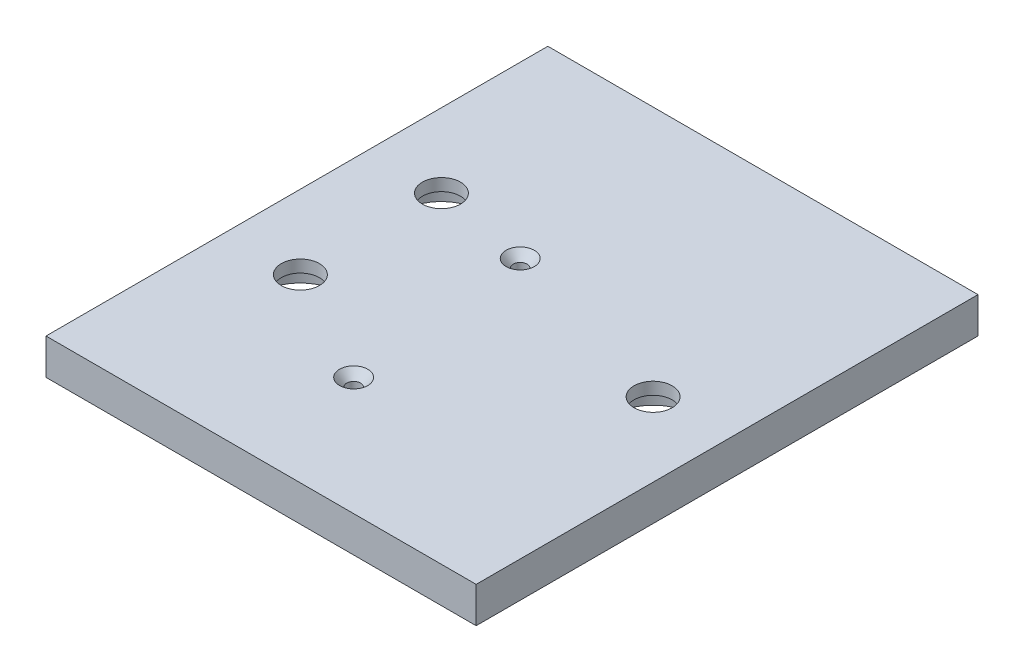
ISO-10303-21;
HEADER;
FILE_DESCRIPTION(('STEP AP214'),'2;1');
FILE_NAME('part.step','',(''),(''),'','','');
FILE_SCHEMA(('AUTOMOTIVE_DESIGN { 1 0 10303 214 1 1 1 1 }'));
ENDSEC;
DATA;
#1=APPLICATION_CONTEXT('core data for automotive mechanical design processes');
#2=APPLICATION_PROTOCOL_DEFINITION('international standard','automotive_design',2000,#1);
#3=PRODUCT_CONTEXT('',#1,'mechanical');
#4=PRODUCT('Part','Part','',(#3));
#5=PRODUCT_RELATED_PRODUCT_CATEGORY('part','',(#4));
#6=PRODUCT_DEFINITION_FORMATION('','',#4);
#7=PRODUCT_DEFINITION_CONTEXT('part definition',#1,'design');
#8=PRODUCT_DEFINITION('design','',#6,#7);
#9=PRODUCT_DEFINITION_SHAPE('','',#8);
#10=(LENGTH_UNIT() NAMED_UNIT(*) SI_UNIT(.MILLI.,.METRE.));
#11=(NAMED_UNIT(*) PLANE_ANGLE_UNIT() SI_UNIT($,.RADIAN.));
#12=(NAMED_UNIT(*) SI_UNIT($,.STERADIAN.) SOLID_ANGLE_UNIT());
#13=UNCERTAINTY_MEASURE_WITH_UNIT(LENGTH_MEASURE(1.E-05),#10,'distance_accuracy_value','');
#14=(GEOMETRIC_REPRESENTATION_CONTEXT(3) GLOBAL_UNCERTAINTY_ASSIGNED_CONTEXT((#13)) GLOBAL_UNIT_ASSIGNED_CONTEXT((#10,
#11,#12)) REPRESENTATION_CONTEXT('',''));
#15=CARTESIAN_POINT('',(0.,0.,0.));
#16=DIRECTION('',(0.,0.,1.));
#17=DIRECTION('',(1.,0.,0.));
#18=AXIS2_PLACEMENT_3D('',#15,#16,#17);
#19=CARTESIAN_POINT('',(0.,6.35,0.));
#20=DIRECTION('',(1.,0.,0.));
#21=DIRECTION('',(0.,0.,-1.));
#22=AXIS2_PLACEMENT_3D('',#19,#20,#21);
#23=PLANE('',#22);
#24=DIRECTION('',(0.,0.,1.));
#25=VECTOR('',#24,1.);
#26=CARTESIAN_POINT('',(0.,0.,0.));
#27=LINE('',#26,#25);
#28=CARTESIAN_POINT('',(0.,0.,-88.9));
#29=VERTEX_POINT('',#28);
#30=CARTESIAN_POINT('',(0.,0.,0.));
#31=VERTEX_POINT('',#30);
#32=EDGE_CURVE('E102',#29,#31,#27,.T.);
#33=ORIENTED_EDGE('',*,*,#32,.T.);
#34=DIRECTION('',(0.,-1.,0.));
#35=VECTOR('',#34,1.);
#36=CARTESIAN_POINT('',(0.,6.35,0.));
#37=LINE('',#36,#35);
#38=CARTESIAN_POINT('',(0.,6.35,0.));
#39=VERTEX_POINT('',#38);
#40=EDGE_CURVE('E11',#39,#31,#37,.T.);
#41=ORIENTED_EDGE('',*,*,#40,.F.);
#42=DIRECTION('',(0.,0.,1.));
#43=VECTOR('',#42,1.);
#44=CARTESIAN_POINT('',(0.,6.35,0.));
#45=LINE('',#44,#43);
#46=CARTESIAN_POINT('',(0.,6.35,-88.9));
#47=VERTEX_POINT('',#46);
#48=EDGE_CURVE('E89',#47,#39,#45,.T.);
#49=ORIENTED_EDGE('',*,*,#48,.F.);
#50=DIRECTION('',(0.,-1.,0.));
#51=VECTOR('',#50,1.);
#52=CARTESIAN_POINT('',(0.,6.35,-88.9));
#53=LINE('',#52,#51);
#54=EDGE_CURVE('E98',#47,#29,#53,.T.);
#55=ORIENTED_EDGE('',*,*,#54,.T.);
#56=EDGE_LOOP('',(#33,#41,#49,#55));
#57=FACE_BOUND('',#56,.T.);
#58=ADVANCED_FACE('F36',(#57),#23,.F.);
#59=CARTESIAN_POINT('',(0.,6.35,0.));
#60=DIRECTION('',(0.,0.,-1.));
#61=DIRECTION('',(-1.,0.,0.));
#62=AXIS2_PLACEMENT_3D('',#59,#60,#61);
#63=PLANE('',#62);
#64=DIRECTION('',(1.,0.,0.));
#65=VECTOR('',#64,1.);
#66=CARTESIAN_POINT('',(0.,0.,0.));
#67=LINE('',#66,#65);
#68=CARTESIAN_POINT('',(76.2,0.,0.));
#69=VERTEX_POINT('',#68);
#70=EDGE_CURVE('E93',#31,#69,#67,.T.);
#71=ORIENTED_EDGE('',*,*,#70,.T.);
#72=DIRECTION('',(0.,-1.,0.));
#73=VECTOR('',#72,1.);
#74=CARTESIAN_POINT('',(76.2,6.35,0.));
#75=LINE('',#74,#73);
#76=CARTESIAN_POINT('',(76.2,6.35,0.));
#77=VERTEX_POINT('',#76);
#78=EDGE_CURVE('E45',#77,#69,#75,.T.);
#79=ORIENTED_EDGE('',*,*,#78,.F.);
#80=DIRECTION('',(1.,0.,0.));
#81=VECTOR('',#80,1.);
#82=CARTESIAN_POINT('',(0.,6.35,0.));
#83=LINE('',#82,#81);
#84=EDGE_CURVE('E84',#39,#77,#83,.T.);
#85=ORIENTED_EDGE('',*,*,#84,.F.);
#86=ORIENTED_EDGE('',*,*,#40,.T.);
#87=EDGE_LOOP('',(#71,#79,#85,#86));
#88=FACE_BOUND('',#87,.T.);
#89=ADVANCED_FACE('F92',(#88),#63,.F.);
#90=CARTESIAN_POINT('',(76.2,6.35,0.));
#91=DIRECTION('',(-1.,0.,0.));
#92=DIRECTION('',(0.,0.,1.));
#93=AXIS2_PLACEMENT_3D('',#90,#91,#92);
#94=PLANE('',#93);
#95=DIRECTION('',(0.,0.,-1.));
#96=VECTOR('',#95,1.);
#97=CARTESIAN_POINT('',(76.2,0.,0.));
#98=LINE('',#97,#96);
#99=CARTESIAN_POINT('',(76.2,0.,-88.9));
#100=VERTEX_POINT('',#99);
#101=EDGE_CURVE('E71',#69,#100,#98,.T.);
#102=ORIENTED_EDGE('',*,*,#101,.T.);
#103=DIRECTION('',(0.,-1.,0.));
#104=VECTOR('',#103,1.);
#105=CARTESIAN_POINT('',(76.2,6.35,-88.9));
#106=LINE('',#105,#104);
#107=CARTESIAN_POINT('',(76.2,6.35,-88.9));
#108=VERTEX_POINT('',#107);
#109=EDGE_CURVE('E94',#108,#100,#106,.T.);
#110=ORIENTED_EDGE('',*,*,#109,.F.);
#111=DIRECTION('',(0.,0.,-1.));
#112=VECTOR('',#111,1.);
#113=CARTESIAN_POINT('',(76.2,6.35,0.));
#114=LINE('',#113,#112);
#115=EDGE_CURVE('E87',#77,#108,#114,.T.);
#116=ORIENTED_EDGE('',*,*,#115,.F.);
#117=ORIENTED_EDGE('',*,*,#78,.T.);
#118=EDGE_LOOP('',(#102,#110,#116,#117));
#119=FACE_BOUND('',#118,.T.);
#120=ADVANCED_FACE('F96',(#119),#94,.F.);
#121=CARTESIAN_POINT('',(0.,6.35,-88.9));
#122=DIRECTION('',(0.,0.,1.));
#123=DIRECTION('',(1.,0.,0.));
#124=AXIS2_PLACEMENT_3D('',#121,#122,#123);
#125=PLANE('',#124);
#126=DIRECTION('',(-1.,0.,0.));
#127=VECTOR('',#126,1.);
#128=CARTESIAN_POINT('',(0.,0.,-88.9));
#129=LINE('',#128,#127);
#130=EDGE_CURVE('E77',#100,#29,#129,.T.);
#131=ORIENTED_EDGE('',*,*,#130,.T.);
#132=ORIENTED_EDGE('',*,*,#54,.F.);
#133=DIRECTION('',(-1.,0.,0.));
#134=VECTOR('',#133,1.);
#135=CARTESIAN_POINT('',(0.,6.35,-88.9));
#136=LINE('',#135,#134);
#137=EDGE_CURVE('E54',#108,#47,#136,.T.);
#138=ORIENTED_EDGE('',*,*,#137,.F.);
#139=ORIENTED_EDGE('',*,*,#109,.T.);
#140=EDGE_LOOP('',(#131,#132,#138,#139));
#141=FACE_BOUND('',#140,.T.);
#142=ADVANCED_FACE('F166',(#141),#125,.F.);
#143=CARTESIAN_POINT('',(0.,6.35,0.));
#144=DIRECTION('',(0.,-1.,0.));
#145=DIRECTION('',(0.,0.,-1.));
#146=AXIS2_PLACEMENT_3D('',#143,#144,#145);
#147=PLANE('',#146);
#148=CARTESIAN_POINT('',(63.0936000000004,6.35,-44.4500000000003));
#149=DIRECTION('',(0.,-1.,0.));
#150=DIRECTION('',(0.,0.,-1.));
#151=AXIS2_PLACEMENT_3D('',#148,#149,#150);
#152=CIRCLE('',#151,3.3782);
#153=CARTESIAN_POINT('',(63.0936000000004,6.35,-47.8282000000003));
#154=VERTEX_POINT('',#153);
#155=EDGE_CURVE('E39',#154,#154,#152,.T.);
#156=ORIENTED_EDGE('',*,*,#155,.T.);
#157=EDGE_LOOP('',(#156));
#158=FACE_BOUND('',#157,.T.);
#159=CARTESIAN_POINT('',(13.1064000000005,6.35,-31.9532000000001));
#160=DIRECTION('',(0.,-1.,0.));
#161=DIRECTION('',(0.,0.,-1.));
#162=AXIS2_PLACEMENT_3D('',#159,#160,#161);
#163=CIRCLE('',#162,3.3782);
#164=CARTESIAN_POINT('',(13.1064000000005,6.35,-35.3314000000001));
#165=VERTEX_POINT('',#164);
#166=EDGE_CURVE('E123',#165,#165,#163,.T.);
#167=ORIENTED_EDGE('',*,*,#166,.T.);
#168=EDGE_LOOP('',(#167));
#169=FACE_BOUND('',#168,.T.);
#170=CARTESIAN_POINT('',(13.1064000000004,6.35,-56.9468000000001));
#171=DIRECTION('',(0.,-1.,0.));
#172=DIRECTION('',(0.,0.,-1.));
#173=AXIS2_PLACEMENT_3D('',#170,#171,#172);
#174=CIRCLE('',#173,3.3782);
#175=CARTESIAN_POINT('',(13.1064000000004,6.35,-60.3250000000001));
#176=VERTEX_POINT('',#175);
#177=EDGE_CURVE('E119',#176,#176,#174,.T.);
#178=ORIENTED_EDGE('',*,*,#177,.T.);
#179=EDGE_LOOP('',(#178));
#180=FACE_BOUND('',#179,.T.);
#181=CARTESIAN_POINT('',(33.6000000000002,6.35,-20.9000000000002));
#182=DIRECTION('',(0.,1.,0.));
#183=DIRECTION('',(0.,0.,1.));
#184=AXIS2_PLACEMENT_3D('',#181,#182,#183);
#185=CIRCLE('',#184,2.5019);
#186=CARTESIAN_POINT('',(33.6000000000002,6.35,-18.3981000000002));
#187=VERTEX_POINT('',#186);
#188=EDGE_CURVE('E121',#187,#187,#185,.T.);
#189=ORIENTED_EDGE('',*,*,#188,.F.);
#190=EDGE_LOOP('',(#189));
#191=FACE_BOUND('',#190,.T.);
#192=CARTESIAN_POINT('',(30.1000000000003,6.35,-53.9000000000001));
#193=DIRECTION('',(0.,1.,0.));
#194=DIRECTION('',(0.,0.,1.));
#195=AXIS2_PLACEMENT_3D('',#192,#193,#194);
#196=CIRCLE('',#195,2.5019);
#197=CARTESIAN_POINT('',(30.1000000000003,6.35,-51.3981000000001));
#198=VERTEX_POINT('',#197);
#199=EDGE_CURVE('E117',#198,#198,#196,.T.);
#200=ORIENTED_EDGE('',*,*,#199,.F.);
#201=EDGE_LOOP('',(#200));
#202=FACE_BOUND('',#201,.T.);
#203=ORIENTED_EDGE('',*,*,#48,.T.);
#204=ORIENTED_EDGE('',*,*,#84,.T.);
#205=ORIENTED_EDGE('',*,*,#115,.T.);
#206=ORIENTED_EDGE('',*,*,#137,.T.);
#207=EDGE_LOOP('',(#203,#204,#205,#206));
#208=FACE_BOUND('',#207,.T.);
#209=ADVANCED_FACE('F85',(#158,#169,#180,#191,#202,#208),#147,.F.);
#210=CARTESIAN_POINT('',(0.,0.,0.));
#211=DIRECTION('',(0.,-1.,0.));
#212=DIRECTION('',(0.,0.,-1.));
#213=AXIS2_PLACEMENT_3D('',#210,#211,#212);
#214=PLANE('',#213);
#215=CARTESIAN_POINT('',(63.0936000000004,0.,-44.4500000000003));
#216=DIRECTION('',(0.,-1.,0.));
#217=DIRECTION('',(0.,0.,-1.));
#218=AXIS2_PLACEMENT_3D('',#215,#216,#217);
#219=CIRCLE('',#218,7.14375);
#220=CARTESIAN_POINT('',(63.0936000000004,0.,-51.5937500000003));
#221=VERTEX_POINT('',#220);
#222=EDGE_CURVE('E337',#221,#221,#219,.T.);
#223=ORIENTED_EDGE('',*,*,#222,.F.);
#224=EDGE_LOOP('',(#223));
#225=FACE_BOUND('',#224,.T.);
#226=CARTESIAN_POINT('',(13.1064000000005,0.,-31.9532000000001));
#227=DIRECTION('',(0.,-1.,0.));
#228=DIRECTION('',(0.,0.,-1.));
#229=AXIS2_PLACEMENT_3D('',#226,#227,#228);
#230=CIRCLE('',#229,7.14375);
#231=CARTESIAN_POINT('',(13.1064000000005,0.,-39.0969500000001));
#232=VERTEX_POINT('',#231);
#233=EDGE_CURVE('E138',#232,#232,#230,.T.);
#234=ORIENTED_EDGE('',*,*,#233,.F.);
#235=EDGE_LOOP('',(#234));
#236=FACE_BOUND('',#235,.T.);
#237=CARTESIAN_POINT('',(13.1064000000004,0.,-56.9468000000001));
#238=DIRECTION('',(0.,-1.,0.));
#239=DIRECTION('',(0.,0.,-1.));
#240=AXIS2_PLACEMENT_3D('',#237,#238,#239);
#241=CIRCLE('',#240,7.14375);
#242=CARTESIAN_POINT('',(13.1064000000004,0.,-64.0905500000001));
#243=VERTEX_POINT('',#242);
#244=EDGE_CURVE('E125',#243,#243,#241,.T.);
#245=ORIENTED_EDGE('',*,*,#244,.F.);
#246=EDGE_LOOP('',(#245));
#247=FACE_BOUND('',#246,.T.);
#248=CARTESIAN_POINT('',(33.6000000000002,0.,-20.9000000000002));
#249=DIRECTION('',(0.,-1.,0.));
#250=DIRECTION('',(0.,0.,-1.));
#251=AXIS2_PLACEMENT_3D('',#248,#249,#250);
#252=CIRCLE('',#251,1.21919999999999);
#253=CARTESIAN_POINT('',(33.6000000000002,0.,-22.1192000000001));
#254=VERTEX_POINT('',#253);
#255=EDGE_CURVE('E114',#254,#254,#252,.T.);
#256=ORIENTED_EDGE('',*,*,#255,.F.);
#257=EDGE_LOOP('',(#256));
#258=FACE_BOUND('',#257,.T.);
#259=CARTESIAN_POINT('',(30.1000000000003,0.,-53.9000000000001));
#260=DIRECTION('',(0.,-1.,0.));
#261=DIRECTION('',(0.,0.,-1.));
#262=AXIS2_PLACEMENT_3D('',#259,#260,#261);
#263=CIRCLE('',#262,1.21919999999999);
#264=CARTESIAN_POINT('',(30.1000000000003,0.,-55.1192000000001));
#265=VERTEX_POINT('',#264);
#266=EDGE_CURVE('E105',#265,#265,#263,.T.);
#267=ORIENTED_EDGE('',*,*,#266,.F.);
#268=EDGE_LOOP('',(#267));
#269=FACE_BOUND('',#268,.T.);
#270=ORIENTED_EDGE('',*,*,#32,.F.);
#271=ORIENTED_EDGE('',*,*,#130,.F.);
#272=ORIENTED_EDGE('',*,*,#101,.F.);
#273=ORIENTED_EDGE('',*,*,#70,.F.);
#274=EDGE_LOOP('',(#270,#271,#272,#273));
#275=FACE_BOUND('',#274,.T.);
#276=ADVANCED_FACE('F165',(#225,#236,#247,#258,#269,#275),#214,.T.);
#277=CARTESIAN_POINT('',(30.1000000000003,6.35,-53.9000000000001));
#278=DIRECTION('',(0.,1.,0.));
#279=DIRECTION('',(0.,0.,1.));
#280=AXIS2_PLACEMENT_3D('',#277,#278,#279);
#281=CYLINDRICAL_SURFACE('',#280,1.21919999999999);
#282=ORIENTED_EDGE('',*,*,#266,.T.);
#283=EDGE_LOOP('',(#282));
#284=FACE_BOUND('',#283,.T.);
#285=CARTESIAN_POINT('',(30.1000000000003,4.87442244405761,-53.9000000000001));
#286=DIRECTION('',(0.,1.,0.));
#287=DIRECTION('',(0.,0.,1.));
#288=AXIS2_PLACEMENT_3D('',#285,#286,#287);
#289=CIRCLE('',#288,1.2192);
#290=CARTESIAN_POINT('',(30.1000000000003,4.87442244405761,-52.6808000000001));
#291=VERTEX_POINT('',#290);
#292=EDGE_CURVE('E113',#291,#291,#289,.T.);
#293=ORIENTED_EDGE('',*,*,#292,.T.);
#294=EDGE_LOOP('',(#293));
#295=FACE_BOUND('',#294,.T.);
#296=ADVANCED_FACE('F155',(#284,#295),#281,.F.);
#297=CARTESIAN_POINT('',(30.1000000000003,6.35,-53.9000000000001));
#298=DIRECTION('',(0.,1.,0.));
#299=DIRECTION('',(0.,0.,1.));
#300=AXIS2_PLACEMENT_3D('',#297,#298,#299);
#301=CONICAL_SURFACE('',#300,2.5019,0.715584993317674);
#302=ORIENTED_EDGE('',*,*,#292,.F.);
#303=EDGE_LOOP('',(#302));
#304=FACE_BOUND('',#303,.T.);
#305=ORIENTED_EDGE('',*,*,#199,.T.);
#306=EDGE_LOOP('',(#305));
#307=FACE_BOUND('',#306,.T.);
#308=ADVANCED_FACE('F157',(#304,#307),#301,.F.);
#309=CARTESIAN_POINT('',(33.6000000000002,6.35,-20.9000000000002));
#310=DIRECTION('',(0.,1.,0.));
#311=DIRECTION('',(0.,0.,1.));
#312=AXIS2_PLACEMENT_3D('',#309,#310,#311);
#313=CYLINDRICAL_SURFACE('',#312,1.21919999999999);
#314=ORIENTED_EDGE('',*,*,#255,.T.);
#315=EDGE_LOOP('',(#314));
#316=FACE_BOUND('',#315,.T.);
#317=CARTESIAN_POINT('',(33.6000000000002,4.87442244405761,-20.9000000000002));
#318=DIRECTION('',(0.,1.,0.));
#319=DIRECTION('',(0.,0.,1.));
#320=AXIS2_PLACEMENT_3D('',#317,#318,#319);
#321=CIRCLE('',#320,1.2192);
#322=CARTESIAN_POINT('',(33.6000000000002,4.87442244405761,-19.6808000000002));
#323=VERTEX_POINT('',#322);
#324=EDGE_CURVE('E118',#323,#323,#321,.T.);
#325=ORIENTED_EDGE('',*,*,#324,.T.);
#326=EDGE_LOOP('',(#325));
#327=FACE_BOUND('',#326,.T.);
#328=ADVANCED_FACE('F160',(#316,#327),#313,.F.);
#329=CARTESIAN_POINT('',(33.6000000000002,6.35,-20.9000000000002));
#330=DIRECTION('',(0.,1.,0.));
#331=DIRECTION('',(0.,0.,1.));
#332=AXIS2_PLACEMENT_3D('',#329,#330,#331);
#333=CONICAL_SURFACE('',#332,2.5019,0.715584993317676);
#334=ORIENTED_EDGE('',*,*,#324,.F.);
#335=EDGE_LOOP('',(#334));
#336=FACE_BOUND('',#335,.T.);
#337=ORIENTED_EDGE('',*,*,#188,.T.);
#338=EDGE_LOOP('',(#337));
#339=FACE_BOUND('',#338,.T.);
#340=ADVANCED_FACE('F220',(#336,#339),#333,.F.);
#341=CARTESIAN_POINT('',(13.1064000000004,0.,-56.9468000000001));
#342=DIRECTION('',(0.,-1.,0.));
#343=DIRECTION('',(0.,0.,-1.));
#344=AXIS2_PLACEMENT_3D('',#341,#342,#343);
#345=CYLINDRICAL_SURFACE('',#344,3.3782);
#346=CARTESIAN_POINT('',(13.1064000000004,4.191,-56.9468000000001));
#347=DIRECTION('',(0.,-1.,0.));
#348=DIRECTION('',(0.,0.,-1.));
#349=AXIS2_PLACEMENT_3D('',#346,#347,#348);
#350=CIRCLE('',#349,3.3782);
#351=CARTESIAN_POINT('',(13.1064000000004,4.191,-60.3250000000001));
#352=VERTEX_POINT('',#351);
#353=EDGE_CURVE('E122',#352,#352,#350,.T.);
#354=ORIENTED_EDGE('',*,*,#353,.T.);
#355=EDGE_LOOP('',(#354));
#356=FACE_BOUND('',#355,.T.);
#357=ORIENTED_EDGE('',*,*,#177,.F.);
#358=EDGE_LOOP('',(#357));
#359=FACE_BOUND('',#358,.T.);
#360=ADVANCED_FACE('F229',(#356,#359),#345,.F.);
#361=CARTESIAN_POINT('',(16.4846000000004,4.191,-56.9468000000001));
#362=DIRECTION('',(0.,1.,0.));
#363=DIRECTION('',(0.,0.,1.));
#364=AXIS2_PLACEMENT_3D('',#361,#362,#363);
#365=PLANE('',#364);
#366=ORIENTED_EDGE('',*,*,#353,.F.);
#367=EDGE_LOOP('',(#366));
#368=FACE_BOUND('',#367,.T.);
#369=CARTESIAN_POINT('',(13.1064000000004,4.191,-56.9468000000001));
#370=DIRECTION('',(0.,-1.,0.));
#371=DIRECTION('',(0.,0.,-1.));
#372=AXIS2_PLACEMENT_3D('',#369,#370,#371);
#373=CIRCLE('',#372,7.14375);
#374=CARTESIAN_POINT('',(13.1064000000004,4.191,-64.0905500000001));
#375=VERTEX_POINT('',#374);
#376=EDGE_CURVE('E130',#375,#375,#373,.T.);
#377=ORIENTED_EDGE('',*,*,#376,.T.);
#378=EDGE_LOOP('',(#377));
#379=FACE_BOUND('',#378,.T.);
#380=ADVANCED_FACE('F248',(#368,#379),#365,.F.);
#381=CARTESIAN_POINT('',(13.1064000000004,0.,-56.9468000000001));
#382=DIRECTION('',(0.,-1.,0.));
#383=DIRECTION('',(0.,0.,-1.));
#384=AXIS2_PLACEMENT_3D('',#381,#382,#383);
#385=CYLINDRICAL_SURFACE('',#384,7.14375);
#386=ORIENTED_EDGE('',*,*,#376,.F.);
#387=EDGE_LOOP('',(#386));
#388=FACE_BOUND('',#387,.T.);
#389=ORIENTED_EDGE('',*,*,#244,.T.);
#390=EDGE_LOOP('',(#389));
#391=FACE_BOUND('',#390,.T.);
#392=ADVANCED_FACE('F258',(#388,#391),#385,.F.);
#393=CARTESIAN_POINT('',(13.1064000000005,0.,-31.9532000000001));
#394=DIRECTION('',(0.,-1.,0.));
#395=DIRECTION('',(0.,0.,-1.));
#396=AXIS2_PLACEMENT_3D('',#393,#394,#395);
#397=CYLINDRICAL_SURFACE('',#396,3.3782);
#398=CARTESIAN_POINT('',(13.1064000000005,4.191,-31.9532000000001));
#399=DIRECTION('',(0.,-1.,0.));
#400=DIRECTION('',(0.,0.,-1.));
#401=AXIS2_PLACEMENT_3D('',#398,#399,#400);
#402=CIRCLE('',#401,3.3782);
#403=CARTESIAN_POINT('',(13.1064000000005,4.191,-35.3314000000001));
#404=VERTEX_POINT('',#403);
#405=EDGE_CURVE('E126',#404,#404,#402,.T.);
#406=ORIENTED_EDGE('',*,*,#405,.T.);
#407=EDGE_LOOP('',(#406));
#408=FACE_BOUND('',#407,.T.);
#409=ORIENTED_EDGE('',*,*,#166,.F.);
#410=EDGE_LOOP('',(#409));
#411=FACE_BOUND('',#410,.T.);
#412=ADVANCED_FACE('F268',(#408,#411),#397,.F.);
#413=CARTESIAN_POINT('',(16.4846000000005,4.191,-31.9532000000001));
#414=DIRECTION('',(0.,1.,0.));
#415=DIRECTION('',(0.,0.,1.));
#416=AXIS2_PLACEMENT_3D('',#413,#414,#415);
#417=PLANE('',#416);
#418=ORIENTED_EDGE('',*,*,#405,.F.);
#419=EDGE_LOOP('',(#418));
#420=FACE_BOUND('',#419,.T.);
#421=CARTESIAN_POINT('',(13.1064000000005,4.191,-31.9532000000001));
#422=DIRECTION('',(0.,-1.,0.));
#423=DIRECTION('',(0.,0.,-1.));
#424=AXIS2_PLACEMENT_3D('',#421,#422,#423);
#425=CIRCLE('',#424,7.14375);
#426=CARTESIAN_POINT('',(13.1064000000005,4.191,-39.0969500000001));
#427=VERTEX_POINT('',#426);
#428=EDGE_CURVE('E133',#427,#427,#425,.T.);
#429=ORIENTED_EDGE('',*,*,#428,.T.);
#430=EDGE_LOOP('',(#429));
#431=FACE_BOUND('',#430,.T.);
#432=ADVANCED_FACE('F278',(#420,#431),#417,.F.);
#433=CARTESIAN_POINT('',(13.1064000000005,0.,-31.9532000000001));
#434=DIRECTION('',(0.,-1.,0.));
#435=DIRECTION('',(0.,0.,-1.));
#436=AXIS2_PLACEMENT_3D('',#433,#434,#435);
#437=CYLINDRICAL_SURFACE('',#436,7.14375);
#438=ORIENTED_EDGE('',*,*,#428,.F.);
#439=EDGE_LOOP('',(#438));
#440=FACE_BOUND('',#439,.T.);
#441=ORIENTED_EDGE('',*,*,#233,.T.);
#442=EDGE_LOOP('',(#441));
#443=FACE_BOUND('',#442,.T.);
#444=ADVANCED_FACE('F287',(#440,#443),#437,.F.);
#445=CARTESIAN_POINT('',(63.0936000000004,0.,-44.4500000000003));
#446=DIRECTION('',(0.,-1.,0.));
#447=DIRECTION('',(0.,0.,-1.));
#448=AXIS2_PLACEMENT_3D('',#445,#446,#447);
#449=CYLINDRICAL_SURFACE('',#448,3.3782);
#450=CARTESIAN_POINT('',(63.0936000000004,4.191,-44.4500000000003));
#451=DIRECTION('',(0.,-1.,0.));
#452=DIRECTION('',(0.,0.,-1.));
#453=AXIS2_PLACEMENT_3D('',#450,#451,#452);
#454=CIRCLE('',#453,3.3782);
#455=CARTESIAN_POINT('',(63.0936000000004,4.191,-47.8282000000003));
#456=VERTEX_POINT('',#455);
#457=EDGE_CURVE('E339',#456,#456,#454,.T.);
#458=ORIENTED_EDGE('',*,*,#457,.T.);
#459=EDGE_LOOP('',(#458));
#460=FACE_BOUND('',#459,.T.);
#461=ORIENTED_EDGE('',*,*,#155,.F.);
#462=EDGE_LOOP('',(#461));
#463=FACE_BOUND('',#462,.T.);
#464=ADVANCED_FACE('F297',(#460,#463),#449,.F.);
#465=CARTESIAN_POINT('',(66.4718000000004,4.191,-44.4500000000003));
#466=DIRECTION('',(0.,1.,0.));
#467=DIRECTION('',(0.,0.,1.));
#468=AXIS2_PLACEMENT_3D('',#465,#466,#467);
#469=PLANE('',#468);
#470=ORIENTED_EDGE('',*,*,#457,.F.);
#471=EDGE_LOOP('',(#470));
#472=FACE_BOUND('',#471,.T.);
#473=CARTESIAN_POINT('',(63.0936000000004,4.191,-44.4500000000003));
#474=DIRECTION('',(0.,-1.,0.));
#475=DIRECTION('',(0.,0.,-1.));
#476=AXIS2_PLACEMENT_3D('',#473,#474,#475);
#477=CIRCLE('',#476,7.14375);
#478=CARTESIAN_POINT('',(63.0936000000004,4.191,-51.5937500000003));
#479=VERTEX_POINT('',#478);
#480=EDGE_CURVE('E334',#479,#479,#477,.T.);
#481=ORIENTED_EDGE('',*,*,#480,.T.);
#482=EDGE_LOOP('',(#481));
#483=FACE_BOUND('',#482,.T.);
#484=ADVANCED_FACE('F307',(#472,#483),#469,.F.);
#485=CARTESIAN_POINT('',(63.0936000000004,0.,-44.4500000000003));
#486=DIRECTION('',(0.,-1.,0.));
#487=DIRECTION('',(0.,0.,-1.));
#488=AXIS2_PLACEMENT_3D('',#485,#486,#487);
#489=CYLINDRICAL_SURFACE('',#488,7.14375);
#490=ORIENTED_EDGE('',*,*,#480,.F.);
#491=EDGE_LOOP('',(#490));
#492=FACE_BOUND('',#491,.T.);
#493=ORIENTED_EDGE('',*,*,#222,.T.);
#494=EDGE_LOOP('',(#493));
#495=FACE_BOUND('',#494,.T.);
#496=ADVANCED_FACE('F317',(#492,#495),#489,.F.);
#497=CLOSED_SHELL('',(#58,#89,#120,#142,#209,#276,#296,#308,#328,#340,#360,#380,#392,#412,#432,
#444,#464,#484,#496));
#498=MANIFOLD_SOLID_BREP('B2',#497);
#499=ADVANCED_BREP_SHAPE_REPRESENTATION('',(#18,#498),#14);
#500=SHAPE_DEFINITION_REPRESENTATION(#9,#499);
ENDSEC;
END-ISO-10303-21;
